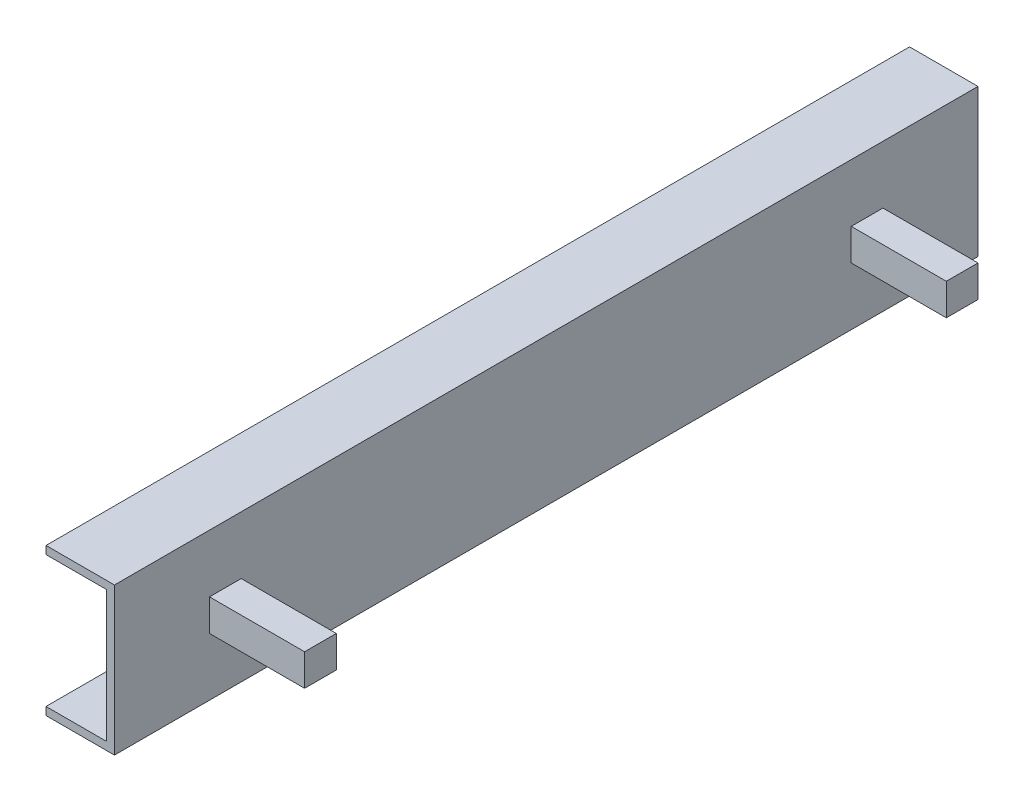
ISO-10303-21;
HEADER;
FILE_DESCRIPTION(('STEP AP214'),'2;1');
FILE_NAME('part.step','',(''),(''),'','','');
FILE_SCHEMA(('AUTOMOTIVE_DESIGN { 1 0 10303 214 1 1 1 1 }'));
ENDSEC;
DATA;
#1=APPLICATION_CONTEXT('core data for automotive mechanical design processes');
#2=APPLICATION_PROTOCOL_DEFINITION('international standard','automotive_design',2000,#1);
#3=PRODUCT_CONTEXT('',#1,'mechanical');
#4=PRODUCT('Part','Part','',(#3));
#5=PRODUCT_RELATED_PRODUCT_CATEGORY('part','',(#4));
#6=PRODUCT_DEFINITION_FORMATION('','',#4);
#7=PRODUCT_DEFINITION_CONTEXT('part definition',#1,'design');
#8=PRODUCT_DEFINITION('design','',#6,#7);
#9=PRODUCT_DEFINITION_SHAPE('','',#8);
#10=(LENGTH_UNIT() NAMED_UNIT(*) SI_UNIT(.MILLI.,.METRE.));
#11=(NAMED_UNIT(*) PLANE_ANGLE_UNIT() SI_UNIT($,.RADIAN.));
#12=(NAMED_UNIT(*) SI_UNIT($,.STERADIAN.) SOLID_ANGLE_UNIT());
#13=UNCERTAINTY_MEASURE_WITH_UNIT(LENGTH_MEASURE(1.E-05),#10,'distance_accuracy_value','');
#14=(GEOMETRIC_REPRESENTATION_CONTEXT(3) GLOBAL_UNCERTAINTY_ASSIGNED_CONTEXT((#13)) GLOBAL_UNIT_ASSIGNED_CONTEXT((#10,
#11,#12)) REPRESENTATION_CONTEXT('',''));
#15=CARTESIAN_POINT('',(0.,0.,0.));
#16=DIRECTION('',(0.,0.,1.));
#17=DIRECTION('',(1.,0.,0.));
#18=AXIS2_PLACEMENT_3D('',#15,#16,#17);
#19=CARTESIAN_POINT('',(0.,0.,346.075));
#20=DIRECTION('',(-1.,0.,0.));
#21=DIRECTION('',(0.,0.,1.));
#22=AXIS2_PLACEMENT_3D('',#19,#20,#21);
#23=PLANE('',#22);
#24=DIRECTION('',(0.,0.,1.));
#25=VECTOR('',#24,1.);
#26=CARTESIAN_POINT('',(0.,-12.7,-269.875));
#27=LINE('',#26,#25);
#28=CARTESIAN_POINT('',(0.,-12.7,-269.875));
#29=VERTEX_POINT('',#28);
#30=CARTESIAN_POINT('',(0.,-12.7,-244.475));
#31=VERTEX_POINT('',#30);
#32=EDGE_CURVE('E183',#29,#31,#27,.T.);
#33=ORIENTED_EDGE('',*,*,#32,.T.);
#34=DIRECTION('',(0.,1.,0.));
#35=VECTOR('',#34,1.);
#36=CARTESIAN_POINT('',(0.,-12.7,-244.475));
#37=LINE('',#36,#35);
#38=CARTESIAN_POINT('',(0.,12.7,-244.475));
#39=VERTEX_POINT('',#38);
#40=EDGE_CURVE('E157',#31,#39,#37,.T.);
#41=ORIENTED_EDGE('',*,*,#40,.T.);
#42=DIRECTION('',(0.,0.,-1.));
#43=VECTOR('',#42,1.);
#44=CARTESIAN_POINT('',(0.,12.7,-269.875));
#45=LINE('',#44,#43);
#46=CARTESIAN_POINT('',(0.,12.7,-269.875));
#47=VERTEX_POINT('',#46);
#48=EDGE_CURVE('E173',#39,#47,#45,.T.);
#49=ORIENTED_EDGE('',*,*,#48,.T.);
#50=DIRECTION('',(0.,-1.,0.));
#51=VECTOR('',#50,1.);
#52=CARTESIAN_POINT('',(0.,-12.7,-269.875));
#53=LINE('',#52,#51);
#54=EDGE_CURVE('E53',#47,#29,#53,.T.);
#55=ORIENTED_EDGE('',*,*,#54,.T.);
#56=EDGE_LOOP('',(#33,#41,#49,#55));
#57=FACE_BOUND('',#56,.T.);
#58=DIRECTION('',(0.,1.,0.));
#59=VECTOR('',#58,1.);
#60=CARTESIAN_POINT('',(0.,0.,-346.075));
#61=LINE('',#60,#59);
#62=CARTESIAN_POINT('',(0.,-59.055,-346.075));
#63=VERTEX_POINT('',#62);
#64=CARTESIAN_POINT('',(0.,59.055,-346.075));
#65=VERTEX_POINT('',#64);
#66=EDGE_CURVE('E249',#63,#65,#61,.T.);
#67=ORIENTED_EDGE('',*,*,#66,.T.);
#68=DIRECTION('',(0.,0.,-1.));
#69=VECTOR('',#68,1.);
#70=CARTESIAN_POINT('',(0.,59.055,346.075));
#71=LINE('',#70,#69);
#72=CARTESIAN_POINT('',(0.,59.055,346.075));
#73=VERTEX_POINT('',#72);
#74=EDGE_CURVE('E11',#73,#65,#71,.T.);
#75=ORIENTED_EDGE('',*,*,#74,.F.);
#76=DIRECTION('',(0.,1.,0.));
#77=VECTOR('',#76,1.);
#78=CARTESIAN_POINT('',(0.,0.,346.075));
#79=LINE('',#78,#77);
#80=CARTESIAN_POINT('',(0.,-59.055,346.075));
#81=VERTEX_POINT('',#80);
#82=EDGE_CURVE('E250',#81,#73,#79,.T.);
#83=ORIENTED_EDGE('',*,*,#82,.F.);
#84=DIRECTION('',(0.,0.,-1.));
#85=VECTOR('',#84,1.);
#86=CARTESIAN_POINT('',(0.,-59.055,346.075));
#87=LINE('',#86,#85);
#88=EDGE_CURVE('E232',#81,#63,#87,.T.);
#89=ORIENTED_EDGE('',*,*,#88,.T.);
#90=EDGE_LOOP('',(#67,#75,#83,#89));
#91=FACE_BOUND('',#90,.T.);
#92=DIRECTION('',(0.,1.,0.));
#93=VECTOR('',#92,1.);
#94=CARTESIAN_POINT('',(0.,-12.7,244.475));
#95=LINE('',#94,#93);
#96=CARTESIAN_POINT('',(0.,-12.7,244.475));
#97=VERTEX_POINT('',#96);
#98=CARTESIAN_POINT('',(0.,12.7,244.475));
#99=VERTEX_POINT('',#98);
#100=EDGE_CURVE('E162',#97,#99,#95,.T.);
#101=ORIENTED_EDGE('',*,*,#100,.F.);
#102=DIRECTION('',(0.,0.,-1.));
#103=VECTOR('',#102,1.);
#104=CARTESIAN_POINT('',(0.,-12.7,269.875));
#105=LINE('',#104,#103);
#106=CARTESIAN_POINT('',(0.,-12.7,269.875));
#107=VERTEX_POINT('',#106);
#108=EDGE_CURVE('E196',#107,#97,#105,.T.);
#109=ORIENTED_EDGE('',*,*,#108,.F.);
#110=DIRECTION('',(0.,-1.,0.));
#111=VECTOR('',#110,1.);
#112=CARTESIAN_POINT('',(0.,-12.7,269.875));
#113=LINE('',#112,#111);
#114=CARTESIAN_POINT('',(0.,12.7,269.875));
#115=VERTEX_POINT('',#114);
#116=EDGE_CURVE('E206',#115,#107,#113,.T.);
#117=ORIENTED_EDGE('',*,*,#116,.F.);
#118=DIRECTION('',(0.,0.,1.));
#119=VECTOR('',#118,1.);
#120=CARTESIAN_POINT('',(0.,12.7,269.875));
#121=LINE('',#120,#119);
#122=EDGE_CURVE('E61',#99,#115,#121,.T.);
#123=ORIENTED_EDGE('',*,*,#122,.F.);
#124=EDGE_LOOP('',(#101,#109,#117,#123));
#125=FACE_BOUND('',#124,.T.);
#126=ADVANCED_FACE('F39',(#57,#91,#125),#23,.F.);
#127=CARTESIAN_POINT('',(0.,59.055,346.075));
#128=DIRECTION('',(0.,-1.,0.));
#129=DIRECTION('',(1.,0.,0.));
#130=AXIS2_PLACEMENT_3D('',#127,#128,#129);
#131=PLANE('',#130);
#132=DIRECTION('',(-1.,0.,0.));
#133=VECTOR('',#132,1.);
#134=CARTESIAN_POINT('',(0.,59.055,-346.075));
#135=LINE('',#134,#133);
#136=CARTESIAN_POINT('',(-54.864,59.055,-346.075));
#137=VERTEX_POINT('',#136);
#138=EDGE_CURVE('E263',#65,#137,#135,.T.);
#139=ORIENTED_EDGE('',*,*,#138,.T.);
#140=DIRECTION('',(0.,0.,-1.));
#141=VECTOR('',#140,1.);
#142=CARTESIAN_POINT('',(-54.864,59.055,346.075));
#143=LINE('',#142,#141);
#144=CARTESIAN_POINT('',(-54.864,59.055,346.075));
#145=VERTEX_POINT('',#144);
#146=EDGE_CURVE('E46',#145,#137,#143,.T.);
#147=ORIENTED_EDGE('',*,*,#146,.F.);
#148=DIRECTION('',(-1.,0.,0.));
#149=VECTOR('',#148,1.);
#150=CARTESIAN_POINT('',(0.,59.055,346.075));
#151=LINE('',#150,#149);
#152=EDGE_CURVE('E252',#73,#145,#151,.T.);
#153=ORIENTED_EDGE('',*,*,#152,.F.);
#154=ORIENTED_EDGE('',*,*,#74,.T.);
#155=EDGE_LOOP('',(#139,#147,#153,#154));
#156=FACE_BOUND('',#155,.T.);
#157=ADVANCED_FACE('F304',(#156),#131,.F.);
#158=CARTESIAN_POINT('',(-54.864,59.055,346.075));
#159=DIRECTION('',(1.,0.,0.));
#160=DIRECTION('',(0.,1.,0.));
#161=AXIS2_PLACEMENT_3D('',#158,#159,#160);
#162=PLANE('',#161);
#163=DIRECTION('',(0.,-1.,0.));
#164=VECTOR('',#163,1.);
#165=CARTESIAN_POINT('',(-54.864,59.055,-346.075));
#166=LINE('',#165,#164);
#167=CARTESIAN_POINT('',(-54.864,52.705,-346.075));
#168=VERTEX_POINT('',#167);
#169=EDGE_CURVE('E265',#137,#168,#166,.T.);
#170=ORIENTED_EDGE('',*,*,#169,.T.);
#171=DIRECTION('',(0.,0.,-1.));
#172=VECTOR('',#171,1.);
#173=CARTESIAN_POINT('',(-54.864,52.705,346.075));
#174=LINE('',#173,#172);
#175=CARTESIAN_POINT('',(-54.864,52.705,346.075));
#176=VERTEX_POINT('',#175);
#177=EDGE_CURVE('E273',#176,#168,#174,.T.);
#178=ORIENTED_EDGE('',*,*,#177,.F.);
#179=DIRECTION('',(0.,-1.,0.));
#180=VECTOR('',#179,1.);
#181=CARTESIAN_POINT('',(-54.864,59.055,346.075));
#182=LINE('',#181,#180);
#183=EDGE_CURVE('E255',#145,#176,#182,.T.);
#184=ORIENTED_EDGE('',*,*,#183,.F.);
#185=ORIENTED_EDGE('',*,*,#146,.T.);
#186=EDGE_LOOP('',(#170,#178,#184,#185));
#187=FACE_BOUND('',#186,.T.);
#188=ADVANCED_FACE('F281',(#187),#162,.F.);
#189=CARTESIAN_POINT('',(-54.864,52.705,346.075));
#190=DIRECTION('',(0.,1.,0.));
#191=DIRECTION('',(-1.,0.,0.));
#192=AXIS2_PLACEMENT_3D('',#189,#190,#191);
#193=PLANE('',#192);
#194=DIRECTION('',(1.,0.,0.));
#195=VECTOR('',#194,1.);
#196=CARTESIAN_POINT('',(-54.864,52.705,-346.075));
#197=LINE('',#196,#195);
#198=CARTESIAN_POINT('',(-6.35000000000001,52.705,-346.075));
#199=VERTEX_POINT('',#198);
#200=EDGE_CURVE('E267',#168,#199,#197,.T.);
#201=ORIENTED_EDGE('',*,*,#200,.T.);
#202=DIRECTION('',(0.,0.,-1.));
#203=VECTOR('',#202,1.);
#204=CARTESIAN_POINT('',(-6.35000000000001,52.705,346.075));
#205=LINE('',#204,#203);
#206=CARTESIAN_POINT('',(-6.35000000000001,52.705,346.075));
#207=VERTEX_POINT('',#206);
#208=EDGE_CURVE('E261',#207,#199,#205,.T.);
#209=ORIENTED_EDGE('',*,*,#208,.F.);
#210=DIRECTION('',(1.,0.,0.));
#211=VECTOR('',#210,1.);
#212=CARTESIAN_POINT('',(-54.864,52.705,346.075));
#213=LINE('',#212,#211);
#214=EDGE_CURVE('E257',#176,#207,#213,.T.);
#215=ORIENTED_EDGE('',*,*,#214,.F.);
#216=ORIENTED_EDGE('',*,*,#177,.T.);
#217=EDGE_LOOP('',(#201,#209,#215,#216));
#218=FACE_BOUND('',#217,.T.);
#219=ADVANCED_FACE('F292',(#218),#193,.F.);
#220=CARTESIAN_POINT('',(-6.35000000000001,52.705,346.075));
#221=DIRECTION('',(1.,0.,0.));
#222=DIRECTION('',(0.,1.,0.));
#223=AXIS2_PLACEMENT_3D('',#220,#221,#222);
#224=PLANE('',#223);
#225=DIRECTION('',(0.,-1.,0.));
#226=VECTOR('',#225,1.);
#227=CARTESIAN_POINT('',(-6.35000000000001,52.705,-346.075));
#228=LINE('',#227,#226);
#229=CARTESIAN_POINT('',(-6.35000000000001,-52.705,-346.075));
#230=VERTEX_POINT('',#229);
#231=EDGE_CURVE('E253',#199,#230,#228,.T.);
#232=ORIENTED_EDGE('',*,*,#231,.T.);
#233=DIRECTION('',(0.,0.,-1.));
#234=VECTOR('',#233,1.);
#235=CARTESIAN_POINT('',(-6.35000000000001,-52.705,346.075));
#236=LINE('',#235,#234);
#237=CARTESIAN_POINT('',(-6.35000000000001,-52.705,346.075));
#238=VERTEX_POINT('',#237);
#239=EDGE_CURVE('E246',#238,#230,#236,.T.);
#240=ORIENTED_EDGE('',*,*,#239,.F.);
#241=DIRECTION('',(0.,-1.,0.));
#242=VECTOR('',#241,1.);
#243=CARTESIAN_POINT('',(-6.35000000000001,52.705,346.075));
#244=LINE('',#243,#242);
#245=EDGE_CURVE('E259',#207,#238,#244,.T.);
#246=ORIENTED_EDGE('',*,*,#245,.F.);
#247=ORIENTED_EDGE('',*,*,#208,.T.);
#248=EDGE_LOOP('',(#232,#240,#246,#247));
#249=FACE_BOUND('',#248,.T.);
#250=ADVANCED_FACE('F296',(#249),#224,.F.);
#251=CARTESIAN_POINT('',(0.,0.,346.075));
#252=DIRECTION('',(0.,0.,1.));
#253=DIRECTION('',(1.,0.,0.));
#254=AXIS2_PLACEMENT_3D('',#251,#252,#253);
#255=PLANE('',#254);
#256=ORIENTED_EDGE('',*,*,#245,.T.);
#257=DIRECTION('',(1.,0.,0.));
#258=VECTOR('',#257,1.);
#259=CARTESIAN_POINT('',(-54.864,-52.705,346.075));
#260=LINE('',#259,#258);
#261=CARTESIAN_POINT('',(-54.864,-52.705,346.075));
#262=VERTEX_POINT('',#261);
#263=EDGE_CURVE('E222',#262,#238,#260,.T.);
#264=ORIENTED_EDGE('',*,*,#263,.F.);
#265=DIRECTION('',(0.,1.,0.));
#266=VECTOR('',#265,1.);
#267=CARTESIAN_POINT('',(-54.864,-59.055,346.075));
#268=LINE('',#267,#266);
#269=CARTESIAN_POINT('',(-54.864,-59.055,346.075));
#270=VERTEX_POINT('',#269);
#271=EDGE_CURVE('E225',#270,#262,#268,.T.);
#272=ORIENTED_EDGE('',*,*,#271,.F.);
#273=DIRECTION('',(-1.,0.,0.));
#274=VECTOR('',#273,1.);
#275=CARTESIAN_POINT('',(0.,-59.055,346.075));
#276=LINE('',#275,#274);
#277=EDGE_CURVE('E229',#81,#270,#276,.T.);
#278=ORIENTED_EDGE('',*,*,#277,.F.);
#279=ORIENTED_EDGE('',*,*,#82,.T.);
#280=ORIENTED_EDGE('',*,*,#152,.T.);
#281=ORIENTED_EDGE('',*,*,#183,.T.);
#282=ORIENTED_EDGE('',*,*,#214,.T.);
#283=EDGE_LOOP('',(#256,#264,#272,#278,#279,#280,#281,#282));
#284=FACE_BOUND('',#283,.T.);
#285=ADVANCED_FACE('F300',(#284),#255,.T.);
#286=CARTESIAN_POINT('',(0.,0.,-346.075));
#287=DIRECTION('',(0.,0.,1.));
#288=DIRECTION('',(1.,0.,0.));
#289=AXIS2_PLACEMENT_3D('',#286,#287,#288);
#290=PLANE('',#289);
#291=ORIENTED_EDGE('',*,*,#66,.F.);
#292=DIRECTION('',(-1.,0.,0.));
#293=VECTOR('',#292,1.);
#294=CARTESIAN_POINT('',(0.,-59.055,-346.075));
#295=LINE('',#294,#293);
#296=CARTESIAN_POINT('',(-54.864,-59.055,-346.075));
#297=VERTEX_POINT('',#296);
#298=EDGE_CURVE('E226',#63,#297,#295,.T.);
#299=ORIENTED_EDGE('',*,*,#298,.T.);
#300=DIRECTION('',(0.,1.,0.));
#301=VECTOR('',#300,1.);
#302=CARTESIAN_POINT('',(-54.864,-59.055,-346.075));
#303=LINE('',#302,#301);
#304=CARTESIAN_POINT('',(-54.864,-52.705,-346.075));
#305=VERTEX_POINT('',#304);
#306=EDGE_CURVE('E235',#297,#305,#303,.T.);
#307=ORIENTED_EDGE('',*,*,#306,.T.);
#308=DIRECTION('',(1.,0.,0.));
#309=VECTOR('',#308,1.);
#310=CARTESIAN_POINT('',(-54.864,-52.705,-346.075));
#311=LINE('',#310,#309);
#312=EDGE_CURVE('E221',#305,#230,#311,.T.);
#313=ORIENTED_EDGE('',*,*,#312,.T.);
#314=ORIENTED_EDGE('',*,*,#231,.F.);
#315=ORIENTED_EDGE('',*,*,#200,.F.);
#316=ORIENTED_EDGE('',*,*,#169,.F.);
#317=ORIENTED_EDGE('',*,*,#138,.F.);
#318=EDGE_LOOP('',(#291,#299,#307,#313,#314,#315,#316,#317));
#319=FACE_BOUND('',#318,.T.);
#320=ADVANCED_FACE('F288',(#319),#290,.F.);
#321=CARTESIAN_POINT('',(-54.864,-52.705,346.075));
#322=DIRECTION('',(0.,1.,0.));
#323=DIRECTION('',(-1.,0.,0.));
#324=AXIS2_PLACEMENT_3D('',#321,#322,#323);
#325=PLANE('',#324);
#326=ORIENTED_EDGE('',*,*,#312,.F.);
#327=DIRECTION('',(0.,0.,-1.));
#328=VECTOR('',#327,1.);
#329=CARTESIAN_POINT('',(-54.864,-52.705,346.075));
#330=LINE('',#329,#328);
#331=EDGE_CURVE('E244',#262,#305,#330,.T.);
#332=ORIENTED_EDGE('',*,*,#331,.F.);
#333=ORIENTED_EDGE('',*,*,#263,.T.);
#334=ORIENTED_EDGE('',*,*,#239,.T.);
#335=EDGE_LOOP('',(#326,#332,#333,#334));
#336=FACE_BOUND('',#335,.T.);
#337=ADVANCED_FACE('F315',(#336),#325,.T.);
#338=CARTESIAN_POINT('',(-54.864,-59.055,346.075));
#339=DIRECTION('',(-1.,0.,0.));
#340=DIRECTION('',(0.,-1.,0.));
#341=AXIS2_PLACEMENT_3D('',#338,#339,#340);
#342=PLANE('',#341);
#343=ORIENTED_EDGE('',*,*,#306,.F.);
#344=DIRECTION('',(0.,0.,-1.));
#345=VECTOR('',#344,1.);
#346=CARTESIAN_POINT('',(-54.864,-59.055,346.075));
#347=LINE('',#346,#345);
#348=EDGE_CURVE('E242',#270,#297,#347,.T.);
#349=ORIENTED_EDGE('',*,*,#348,.F.);
#350=ORIENTED_EDGE('',*,*,#271,.T.);
#351=ORIENTED_EDGE('',*,*,#331,.T.);
#352=EDGE_LOOP('',(#343,#349,#350,#351));
#353=FACE_BOUND('',#352,.T.);
#354=ADVANCED_FACE('F312',(#353),#342,.T.);
#355=CARTESIAN_POINT('',(0.,-59.055,346.075));
#356=DIRECTION('',(0.,-1.,0.));
#357=DIRECTION('',(1.,0.,0.));
#358=AXIS2_PLACEMENT_3D('',#355,#356,#357);
#359=PLANE('',#358);
#360=ORIENTED_EDGE('',*,*,#298,.F.);
#361=ORIENTED_EDGE('',*,*,#88,.F.);
#362=ORIENTED_EDGE('',*,*,#277,.T.);
#363=ORIENTED_EDGE('',*,*,#348,.T.);
#364=EDGE_LOOP('',(#360,#361,#362,#363));
#365=FACE_BOUND('',#364,.T.);
#366=ADVANCED_FACE('F310',(#365),#359,.T.);
#367=CARTESIAN_POINT('',(76.2,-12.7,244.475));
#368=DIRECTION('',(0.,0.,1.));
#369=DIRECTION('',(1.,0.,0.));
#370=AXIS2_PLACEMENT_3D('',#367,#368,#369);
#371=PLANE('',#370);
#372=ORIENTED_EDGE('',*,*,#100,.T.);
#373=DIRECTION('',(-1.,0.,0.));
#374=VECTOR('',#373,1.);
#375=CARTESIAN_POINT('',(76.2,12.7,244.475));
#376=LINE('',#375,#374);
#377=CARTESIAN_POINT('',(76.2,12.7,244.475));
#378=VERTEX_POINT('',#377);
#379=EDGE_CURVE('E219',#378,#99,#376,.T.);
#380=ORIENTED_EDGE('',*,*,#379,.F.);
#381=DIRECTION('',(0.,1.,0.));
#382=VECTOR('',#381,1.);
#383=CARTESIAN_POINT('',(76.2,-12.7,244.475));
#384=LINE('',#383,#382);
#385=CARTESIAN_POINT('',(76.2,-12.7,244.475));
#386=VERTEX_POINT('',#385);
#387=EDGE_CURVE('E192',#386,#378,#384,.T.);
#388=ORIENTED_EDGE('',*,*,#387,.F.);
#389=DIRECTION('',(-1.,0.,0.));
#390=VECTOR('',#389,1.);
#391=CARTESIAN_POINT('',(76.2,-12.7,244.475));
#392=LINE('',#391,#390);
#393=EDGE_CURVE('E202',#386,#97,#392,.T.);
#394=ORIENTED_EDGE('',*,*,#393,.T.);
#395=EDGE_LOOP('',(#372,#380,#388,#394));
#396=FACE_BOUND('',#395,.T.);
#397=ADVANCED_FACE('F361',(#396),#371,.F.);
#398=CARTESIAN_POINT('',(76.2,12.7,269.875));
#399=DIRECTION('',(0.,-1.,0.));
#400=DIRECTION('',(0.,0.,-1.));
#401=AXIS2_PLACEMENT_3D('',#398,#399,#400);
#402=PLANE('',#401);
#403=ORIENTED_EDGE('',*,*,#122,.T.);
#404=DIRECTION('',(-1.,0.,0.));
#405=VECTOR('',#404,1.);
#406=CARTESIAN_POINT('',(76.2,12.7,269.875));
#407=LINE('',#406,#405);
#408=CARTESIAN_POINT('',(76.2,12.7,269.875));
#409=VERTEX_POINT('',#408);
#410=EDGE_CURVE('E216',#409,#115,#407,.T.);
#411=ORIENTED_EDGE('',*,*,#410,.F.);
#412=DIRECTION('',(0.,0.,1.));
#413=VECTOR('',#412,1.);
#414=CARTESIAN_POINT('',(76.2,12.7,269.875));
#415=LINE('',#414,#413);
#416=EDGE_CURVE('E195',#378,#409,#415,.T.);
#417=ORIENTED_EDGE('',*,*,#416,.F.);
#418=ORIENTED_EDGE('',*,*,#379,.T.);
#419=EDGE_LOOP('',(#403,#411,#417,#418));
#420=FACE_BOUND('',#419,.T.);
#421=ADVANCED_FACE('F357',(#420),#402,.F.);
#422=CARTESIAN_POINT('',(76.2,-12.7,269.875));
#423=DIRECTION('',(0.,0.,-1.));
#424=DIRECTION('',(-1.,0.,0.));
#425=AXIS2_PLACEMENT_3D('',#422,#423,#424);
#426=PLANE('',#425);
#427=ORIENTED_EDGE('',*,*,#116,.T.);
#428=DIRECTION('',(-1.,0.,0.));
#429=VECTOR('',#428,1.);
#430=CARTESIAN_POINT('',(76.2,-12.7,269.875));
#431=LINE('',#430,#429);
#432=CARTESIAN_POINT('',(76.2,-12.7,269.875));
#433=VERTEX_POINT('',#432);
#434=EDGE_CURVE('E213',#433,#107,#431,.T.);
#435=ORIENTED_EDGE('',*,*,#434,.F.);
#436=DIRECTION('',(0.,-1.,0.));
#437=VECTOR('',#436,1.);
#438=CARTESIAN_POINT('',(76.2,-12.7,269.875));
#439=LINE('',#438,#437);
#440=EDGE_CURVE('E198',#409,#433,#439,.T.);
#441=ORIENTED_EDGE('',*,*,#440,.F.);
#442=ORIENTED_EDGE('',*,*,#410,.T.);
#443=EDGE_LOOP('',(#427,#435,#441,#442));
#444=FACE_BOUND('',#443,.T.);
#445=ADVANCED_FACE('F353',(#444),#426,.F.);
#446=CARTESIAN_POINT('',(76.2,-12.7,269.875));
#447=DIRECTION('',(0.,1.,0.));
#448=DIRECTION('',(0.,0.,1.));
#449=AXIS2_PLACEMENT_3D('',#446,#447,#448);
#450=PLANE('',#449);
#451=ORIENTED_EDGE('',*,*,#108,.T.);
#452=ORIENTED_EDGE('',*,*,#393,.F.);
#453=DIRECTION('',(0.,0.,-1.));
#454=VECTOR('',#453,1.);
#455=CARTESIAN_POINT('',(76.2,-12.7,269.875));
#456=LINE('',#455,#454);
#457=EDGE_CURVE('E200',#433,#386,#456,.T.);
#458=ORIENTED_EDGE('',*,*,#457,.F.);
#459=ORIENTED_EDGE('',*,*,#434,.T.);
#460=EDGE_LOOP('',(#451,#452,#458,#459));
#461=FACE_BOUND('',#460,.T.);
#462=ADVANCED_FACE('F349',(#461),#450,.F.);
#463=CARTESIAN_POINT('',(76.2,12.7,244.475));
#464=DIRECTION('',(-1.,0.,0.));
#465=DIRECTION('',(0.,0.,1.));
#466=AXIS2_PLACEMENT_3D('',#463,#464,#465);
#467=PLANE('',#466);
#468=ORIENTED_EDGE('',*,*,#387,.T.);
#469=ORIENTED_EDGE('',*,*,#416,.T.);
#470=ORIENTED_EDGE('',*,*,#440,.T.);
#471=ORIENTED_EDGE('',*,*,#457,.T.);
#472=EDGE_LOOP('',(#468,#469,#470,#471));
#473=FACE_BOUND('',#472,.T.);
#474=ADVANCED_FACE('F346',(#473),#467,.F.);
#475=CARTESIAN_POINT('',(76.2,-12.7,-244.475));
#476=DIRECTION('',(0.,0.,1.));
#477=DIRECTION('',(1.,0.,0.));
#478=AXIS2_PLACEMENT_3D('',#475,#476,#477);
#479=PLANE('',#478);
#480=ORIENTED_EDGE('',*,*,#40,.F.);
#481=DIRECTION('',(-1.,0.,0.));
#482=VECTOR('',#481,1.);
#483=CARTESIAN_POINT('',(76.2,-12.7,-244.475));
#484=LINE('',#483,#482);
#485=CARTESIAN_POINT('',(76.2,-12.7,-244.475));
#486=VERTEX_POINT('',#485);
#487=EDGE_CURVE('E151',#486,#31,#484,.T.);
#488=ORIENTED_EDGE('',*,*,#487,.F.);
#489=DIRECTION('',(0.,1.,0.));
#490=VECTOR('',#489,1.);
#491=CARTESIAN_POINT('',(76.2,-12.7,-244.475));
#492=LINE('',#491,#490);
#493=CARTESIAN_POINT('',(76.2,12.7,-244.475));
#494=VERTEX_POINT('',#493);
#495=EDGE_CURVE('E154',#486,#494,#492,.T.);
#496=ORIENTED_EDGE('',*,*,#495,.T.);
#497=DIRECTION('',(-1.,0.,0.));
#498=VECTOR('',#497,1.);
#499=CARTESIAN_POINT('',(76.2,12.7,-244.475));
#500=LINE('',#499,#498);
#501=EDGE_CURVE('E181',#494,#39,#500,.T.);
#502=ORIENTED_EDGE('',*,*,#501,.T.);
#503=EDGE_LOOP('',(#480,#488,#496,#502));
#504=FACE_BOUND('',#503,.T.);
#505=ADVANCED_FACE('F153',(#504),#479,.T.);
#506=CARTESIAN_POINT('',(76.2,-12.7,-269.875));
#507=DIRECTION('',(0.,-1.,0.));
#508=DIRECTION('',(0.,0.,-1.));
#509=AXIS2_PLACEMENT_3D('',#506,#507,#508);
#510=PLANE('',#509);
#511=ORIENTED_EDGE('',*,*,#32,.F.);
#512=DIRECTION('',(-1.,0.,0.));
#513=VECTOR('',#512,1.);
#514=CARTESIAN_POINT('',(76.2,-12.7,-269.875));
#515=LINE('',#514,#513);
#516=CARTESIAN_POINT('',(76.2,-12.7,-269.875));
#517=VERTEX_POINT('',#516);
#518=EDGE_CURVE('E163',#517,#29,#515,.T.);
#519=ORIENTED_EDGE('',*,*,#518,.F.);
#520=DIRECTION('',(0.,0.,1.));
#521=VECTOR('',#520,1.);
#522=CARTESIAN_POINT('',(76.2,-12.7,-269.875));
#523=LINE('',#522,#521);
#524=EDGE_CURVE('E169',#517,#486,#523,.T.);
#525=ORIENTED_EDGE('',*,*,#524,.T.);
#526=ORIENTED_EDGE('',*,*,#487,.T.);
#527=EDGE_LOOP('',(#511,#519,#525,#526));
#528=FACE_BOUND('',#527,.T.);
#529=ADVANCED_FACE('F175',(#528),#510,.T.);
#530=CARTESIAN_POINT('',(76.2,-12.7,-269.875));
#531=DIRECTION('',(0.,0.,-1.));
#532=DIRECTION('',(-1.,0.,0.));
#533=AXIS2_PLACEMENT_3D('',#530,#531,#532);
#534=PLANE('',#533);
#535=ORIENTED_EDGE('',*,*,#54,.F.);
#536=DIRECTION('',(-1.,0.,0.));
#537=VECTOR('',#536,1.);
#538=CARTESIAN_POINT('',(76.2,12.7,-269.875));
#539=LINE('',#538,#537);
#540=CARTESIAN_POINT('',(76.2,12.7,-269.875));
#541=VERTEX_POINT('',#540);
#542=EDGE_CURVE('E189',#541,#47,#539,.T.);
#543=ORIENTED_EDGE('',*,*,#542,.F.);
#544=DIRECTION('',(0.,-1.,0.));
#545=VECTOR('',#544,1.);
#546=CARTESIAN_POINT('',(76.2,-12.7,-269.875));
#547=LINE('',#546,#545);
#548=EDGE_CURVE('E176',#541,#517,#547,.T.);
#549=ORIENTED_EDGE('',*,*,#548,.T.);
#550=ORIENTED_EDGE('',*,*,#518,.T.);
#551=EDGE_LOOP('',(#535,#543,#549,#550));
#552=FACE_BOUND('',#551,.T.);
#553=ADVANCED_FACE('F333',(#552),#534,.T.);
#554=CARTESIAN_POINT('',(76.2,12.7,-269.875));
#555=DIRECTION('',(0.,1.,0.));
#556=DIRECTION('',(0.,0.,1.));
#557=AXIS2_PLACEMENT_3D('',#554,#555,#556);
#558=PLANE('',#557);
#559=ORIENTED_EDGE('',*,*,#48,.F.);
#560=ORIENTED_EDGE('',*,*,#501,.F.);
#561=DIRECTION('',(0.,0.,-1.));
#562=VECTOR('',#561,1.);
#563=CARTESIAN_POINT('',(76.2,12.7,-269.875));
#564=LINE('',#563,#562);
#565=EDGE_CURVE('E172',#494,#541,#564,.T.);
#566=ORIENTED_EDGE('',*,*,#565,.T.);
#567=ORIENTED_EDGE('',*,*,#542,.T.);
#568=EDGE_LOOP('',(#559,#560,#566,#567));
#569=FACE_BOUND('',#568,.T.);
#570=ADVANCED_FACE('F332',(#569),#558,.T.);
#571=CARTESIAN_POINT('',(76.2,12.7,-244.475));
#572=DIRECTION('',(-1.,0.,0.));
#573=DIRECTION('',(0.,0.,-1.));
#574=AXIS2_PLACEMENT_3D('',#571,#572,#573);
#575=PLANE('',#574);
#576=ORIENTED_EDGE('',*,*,#495,.F.);
#577=ORIENTED_EDGE('',*,*,#524,.F.);
#578=ORIENTED_EDGE('',*,*,#548,.F.);
#579=ORIENTED_EDGE('',*,*,#565,.F.);
#580=EDGE_LOOP('',(#576,#577,#578,#579));
#581=FACE_BOUND('',#580,.T.);
#582=ADVANCED_FACE('F167',(#581),#575,.F.);
#583=CLOSED_SHELL('',(#126,#157,#188,#219,#250,#285,#320,#337,#354,#366,#397,#421,#445,#462,
#474,#505,#529,#553,#570,#582));
#584=MANIFOLD_SOLID_BREP('B2',#583);
#585=ADVANCED_BREP_SHAPE_REPRESENTATION('',(#18,#584),#14);
#586=SHAPE_DEFINITION_REPRESENTATION(#9,#585);
ENDSEC;
END-ISO-10303-21;
